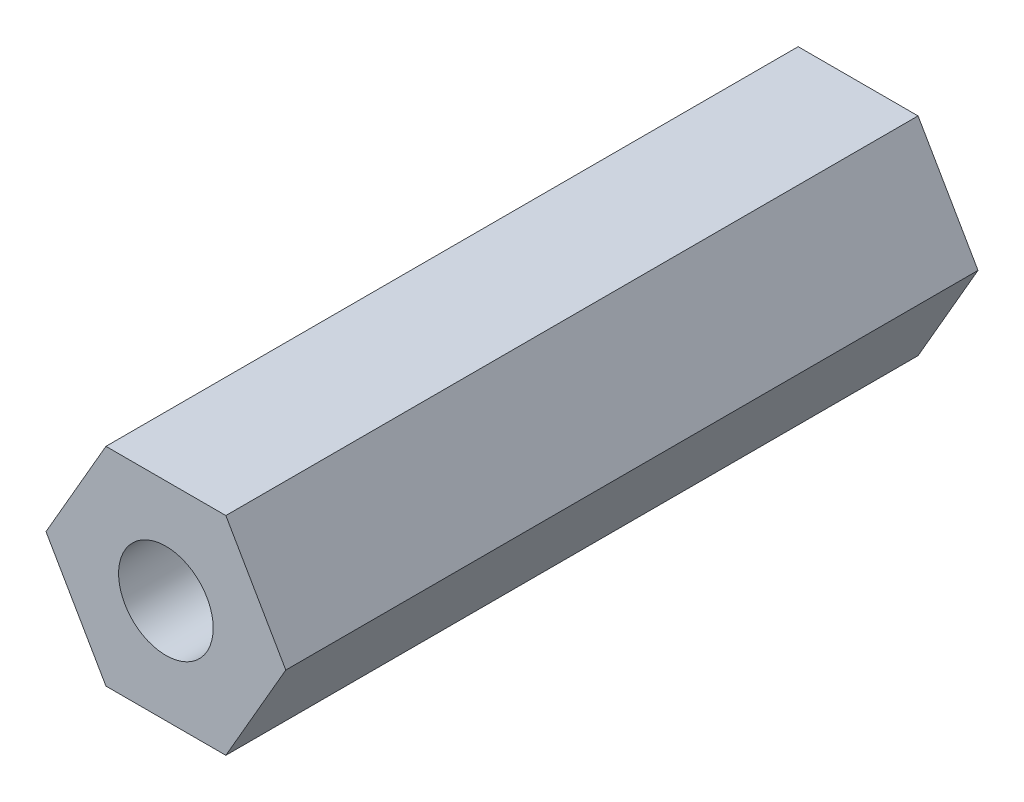
ISO-10303-21;
HEADER;
FILE_DESCRIPTION(('STEP AP214'),'2;1');
FILE_NAME('part.step','',(''),(''),'','','');
FILE_SCHEMA(('AUTOMOTIVE_DESIGN { 1 0 10303 214 1 1 1 1 }'));
ENDSEC;
DATA;
#1=APPLICATION_CONTEXT('core data for automotive mechanical design processes');
#2=APPLICATION_PROTOCOL_DEFINITION('international standard','automotive_design',2000,#1);
#3=PRODUCT_CONTEXT('',#1,'mechanical');
#4=PRODUCT('Part','Part','',(#3));
#5=PRODUCT_RELATED_PRODUCT_CATEGORY('part','',(#4));
#6=PRODUCT_DEFINITION_FORMATION('','',#4);
#7=PRODUCT_DEFINITION_CONTEXT('part definition',#1,'design');
#8=PRODUCT_DEFINITION('design','',#6,#7);
#9=PRODUCT_DEFINITION_SHAPE('','',#8);
#10=(LENGTH_UNIT() NAMED_UNIT(*) SI_UNIT(.MILLI.,.METRE.));
#11=(NAMED_UNIT(*) PLANE_ANGLE_UNIT() SI_UNIT($,.RADIAN.));
#12=(NAMED_UNIT(*) SI_UNIT($,.STERADIAN.) SOLID_ANGLE_UNIT());
#13=UNCERTAINTY_MEASURE_WITH_UNIT(LENGTH_MEASURE(1.E-05),#10,'distance_accuracy_value','');
#14=(GEOMETRIC_REPRESENTATION_CONTEXT(3) GLOBAL_UNCERTAINTY_ASSIGNED_CONTEXT((#13)) GLOBAL_UNIT_ASSIGNED_CONTEXT((#10,
#11,#12)) REPRESENTATION_CONTEXT('',''));
#15=CARTESIAN_POINT('',(0.,0.,0.));
#16=DIRECTION('',(0.,0.,1.));
#17=DIRECTION('',(1.,0.,0.));
#18=AXIS2_PLACEMENT_3D('',#15,#16,#17);
#19=CARTESIAN_POINT('',(1.29903810567666,2.25,15.));
#20=DIRECTION('',(0.,-1.,0.));
#21=DIRECTION('',(0.,0.,-1.));
#22=AXIS2_PLACEMENT_3D('',#19,#20,#21);
#23=PLANE('',#22);
#24=DIRECTION('',(-1.,0.,0.));
#25=VECTOR('',#24,1.);
#26=CARTESIAN_POINT('',(1.29903810567666,2.25,0.));
#27=LINE('',#26,#25);
#28=CARTESIAN_POINT('',(1.29903810567666,2.25,0.));
#29=VERTEX_POINT('',#28);
#30=CARTESIAN_POINT('',(-1.29903810567666,2.25,0.));
#31=VERTEX_POINT('',#30);
#32=EDGE_CURVE('E116',#29,#31,#27,.T.);
#33=ORIENTED_EDGE('',*,*,#32,.T.);
#34=DIRECTION('',(0.,0.,-1.));
#35=VECTOR('',#34,1.);
#36=CARTESIAN_POINT('',(-1.29903810567666,2.25,15.));
#37=LINE('',#36,#35);
#38=CARTESIAN_POINT('',(-1.29903810567666,2.25,15.));
#39=VERTEX_POINT('',#38);
#40=EDGE_CURVE('E11',#39,#31,#37,.T.);
#41=ORIENTED_EDGE('',*,*,#40,.F.);
#42=DIRECTION('',(-1.,0.,0.));
#43=VECTOR('',#42,1.);
#44=CARTESIAN_POINT('',(1.29903810567666,2.25,15.));
#45=LINE('',#44,#43);
#46=CARTESIAN_POINT('',(1.29903810567666,2.25,15.));
#47=VERTEX_POINT('',#46);
#48=EDGE_CURVE('E127',#47,#39,#45,.T.);
#49=ORIENTED_EDGE('',*,*,#48,.F.);
#50=DIRECTION('',(0.,0.,-1.));
#51=VECTOR('',#50,1.);
#52=CARTESIAN_POINT('',(1.29903810567666,2.25,15.));
#53=LINE('',#52,#51);
#54=EDGE_CURVE('E112',#47,#29,#53,.T.);
#55=ORIENTED_EDGE('',*,*,#54,.T.);
#56=EDGE_LOOP('',(#33,#41,#49,#55));
#57=FACE_BOUND('',#56,.T.);
#58=ADVANCED_FACE('F32',(#57),#23,.F.);
#59=CARTESIAN_POINT('',(-1.29903810567666,2.25,15.));
#60=DIRECTION('',(0.866025403784439,-0.5,0.));
#61=DIRECTION('',(0.5,0.866025403784439,0.));
#62=AXIS2_PLACEMENT_3D('',#59,#60,#61);
#63=PLANE('',#62);
#64=DIRECTION('',(-0.5,-0.866025403784439,0.));
#65=VECTOR('',#64,1.);
#66=CARTESIAN_POINT('',(-1.29903810567666,2.25,0.));
#67=LINE('',#66,#65);
#68=CARTESIAN_POINT('',(-2.59807621135332,0.,0.));
#69=VERTEX_POINT('',#68);
#70=EDGE_CURVE('E119',#31,#69,#67,.T.);
#71=ORIENTED_EDGE('',*,*,#70,.T.);
#72=DIRECTION('',(0.,0.,-1.));
#73=VECTOR('',#72,1.);
#74=CARTESIAN_POINT('',(-2.59807621135332,0.,15.));
#75=LINE('',#74,#73);
#76=CARTESIAN_POINT('',(-2.59807621135332,0.,15.));
#77=VERTEX_POINT('',#76);
#78=EDGE_CURVE('E40',#77,#69,#75,.T.);
#79=ORIENTED_EDGE('',*,*,#78,.F.);
#80=DIRECTION('',(-0.5,-0.866025403784439,0.));
#81=VECTOR('',#80,1.);
#82=CARTESIAN_POINT('',(-1.29903810567666,2.25,15.));
#83=LINE('',#82,#81);
#84=EDGE_CURVE('E85',#39,#77,#83,.T.);
#85=ORIENTED_EDGE('',*,*,#84,.F.);
#86=ORIENTED_EDGE('',*,*,#40,.T.);
#87=EDGE_LOOP('',(#71,#79,#85,#86));
#88=FACE_BOUND('',#87,.T.);
#89=ADVANCED_FACE('F152',(#88),#63,.F.);
#90=CARTESIAN_POINT('',(-2.59807621135332,0.,15.));
#91=DIRECTION('',(0.866025403784438,0.5,0.));
#92=DIRECTION('',(-0.5,0.866025403784439,0.));
#93=AXIS2_PLACEMENT_3D('',#90,#91,#92);
#94=PLANE('',#93);
#95=DIRECTION('',(0.5,-0.866025403784438,0.));
#96=VECTOR('',#95,1.);
#97=CARTESIAN_POINT('',(-2.59807621135332,0.,0.));
#98=LINE('',#97,#96);
#99=CARTESIAN_POINT('',(-1.29903810567666,-2.25,0.));
#100=VERTEX_POINT('',#99);
#101=EDGE_CURVE('E122',#69,#100,#98,.T.);
#102=ORIENTED_EDGE('',*,*,#101,.T.);
#103=DIRECTION('',(0.,0.,-1.));
#104=VECTOR('',#103,1.);
#105=CARTESIAN_POINT('',(-1.29903810567666,-2.25,15.));
#106=LINE('',#105,#104);
#107=CARTESIAN_POINT('',(-1.29903810567666,-2.25,15.));
#108=VERTEX_POINT('',#107);
#109=EDGE_CURVE('E107',#108,#100,#106,.T.);
#110=ORIENTED_EDGE('',*,*,#109,.F.);
#111=DIRECTION('',(0.5,-0.866025403784438,0.));
#112=VECTOR('',#111,1.);
#113=CARTESIAN_POINT('',(-2.59807621135332,0.,15.));
#114=LINE('',#113,#112);
#115=EDGE_CURVE('E98',#77,#108,#114,.T.);
#116=ORIENTED_EDGE('',*,*,#115,.F.);
#117=ORIENTED_EDGE('',*,*,#78,.T.);
#118=EDGE_LOOP('',(#102,#110,#116,#117));
#119=FACE_BOUND('',#118,.T.);
#120=ADVANCED_FACE('F133',(#119),#94,.F.);
#121=CARTESIAN_POINT('',(-1.29903810567666,-2.25,15.));
#122=DIRECTION('',(0.,1.,0.));
#123=DIRECTION('',(-1.,0.,0.));
#124=AXIS2_PLACEMENT_3D('',#121,#122,#123);
#125=PLANE('',#124);
#126=DIRECTION('',(1.,0.,0.));
#127=VECTOR('',#126,1.);
#128=CARTESIAN_POINT('',(-1.29903810567666,-2.25,0.));
#129=LINE('',#128,#127);
#130=CARTESIAN_POINT('',(1.29903810567666,-2.25,0.));
#131=VERTEX_POINT('',#130);
#132=EDGE_CURVE('E106',#100,#131,#129,.T.);
#133=ORIENTED_EDGE('',*,*,#132,.T.);
#134=DIRECTION('',(0.,0.,-1.));
#135=VECTOR('',#134,1.);
#136=CARTESIAN_POINT('',(1.29903810567666,-2.25,15.));
#137=LINE('',#136,#135);
#138=CARTESIAN_POINT('',(1.29903810567666,-2.25,15.));
#139=VERTEX_POINT('',#138);
#140=EDGE_CURVE('E103',#139,#131,#137,.T.);
#141=ORIENTED_EDGE('',*,*,#140,.F.);
#142=DIRECTION('',(1.,0.,0.));
#143=VECTOR('',#142,1.);
#144=CARTESIAN_POINT('',(-1.29903810567666,-2.25,15.));
#145=LINE('',#144,#143);
#146=EDGE_CURVE('E92',#108,#139,#145,.T.);
#147=ORIENTED_EDGE('',*,*,#146,.F.);
#148=ORIENTED_EDGE('',*,*,#109,.T.);
#149=EDGE_LOOP('',(#133,#141,#147,#148));
#150=FACE_BOUND('',#149,.T.);
#151=ADVANCED_FACE('F104',(#150),#125,.F.);
#152=CARTESIAN_POINT('',(1.29903810567666,-2.25,15.));
#153=DIRECTION('',(-0.866025403784439,0.5,0.));
#154=DIRECTION('',(-0.5,-0.866025403784439,0.));
#155=AXIS2_PLACEMENT_3D('',#152,#153,#154);
#156=PLANE('',#155);
#157=DIRECTION('',(0.5,0.866025403784439,0.));
#158=VECTOR('',#157,1.);
#159=CARTESIAN_POINT('',(1.29903810567666,-2.25,0.));
#160=LINE('',#159,#158);
#161=CARTESIAN_POINT('',(2.59807621135332,0.,0.));
#162=VERTEX_POINT('',#161);
#163=EDGE_CURVE('E71',#131,#162,#160,.T.);
#164=ORIENTED_EDGE('',*,*,#163,.T.);
#165=DIRECTION('',(0.,0.,-1.));
#166=VECTOR('',#165,1.);
#167=CARTESIAN_POINT('',(2.59807621135332,0.,15.));
#168=LINE('',#167,#166);
#169=CARTESIAN_POINT('',(2.59807621135332,0.,15.));
#170=VERTEX_POINT('',#169);
#171=EDGE_CURVE('E108',#170,#162,#168,.T.);
#172=ORIENTED_EDGE('',*,*,#171,.F.);
#173=DIRECTION('',(0.5,0.866025403784439,0.));
#174=VECTOR('',#173,1.);
#175=CARTESIAN_POINT('',(1.29903810567666,-2.25,15.));
#176=LINE('',#175,#174);
#177=EDGE_CURVE('E96',#139,#170,#176,.T.);
#178=ORIENTED_EDGE('',*,*,#177,.F.);
#179=ORIENTED_EDGE('',*,*,#140,.T.);
#180=EDGE_LOOP('',(#164,#172,#178,#179));
#181=FACE_BOUND('',#180,.T.);
#182=ADVANCED_FACE('F110',(#181),#156,.F.);
#183=CARTESIAN_POINT('',(2.59807621135332,0.,15.));
#184=DIRECTION('',(-0.866025403784438,-0.5,0.));
#185=DIRECTION('',(0.5,-0.866025403784439,0.));
#186=AXIS2_PLACEMENT_3D('',#183,#184,#185);
#187=PLANE('',#186);
#188=DIRECTION('',(-0.5,0.866025403784438,0.));
#189=VECTOR('',#188,1.);
#190=CARTESIAN_POINT('',(2.59807621135332,0.,0.));
#191=LINE('',#190,#189);
#192=EDGE_CURVE('E77',#162,#29,#191,.T.);
#193=ORIENTED_EDGE('',*,*,#192,.T.);
#194=ORIENTED_EDGE('',*,*,#54,.F.);
#195=DIRECTION('',(-0.5,0.866025403784438,0.));
#196=VECTOR('',#195,1.);
#197=CARTESIAN_POINT('',(2.59807621135332,0.,15.));
#198=LINE('',#197,#196);
#199=EDGE_CURVE('E48',#170,#47,#198,.T.);
#200=ORIENTED_EDGE('',*,*,#199,.F.);
#201=ORIENTED_EDGE('',*,*,#171,.T.);
#202=EDGE_LOOP('',(#193,#194,#200,#201));
#203=FACE_BOUND('',#202,.T.);
#204=ADVANCED_FACE('F140',(#203),#187,.F.);
#205=CARTESIAN_POINT('',(-1.29903810567666,2.25,15.));
#206=DIRECTION('',(0.,0.,1.));
#207=DIRECTION('',(1.,0.,0.));
#208=AXIS2_PLACEMENT_3D('',#205,#206,#207);
#209=PLANE('',#208);
#210=CARTESIAN_POINT('',(0.,0.,15.));
#211=DIRECTION('',(0.,0.,1.));
#212=DIRECTION('',(1.,0.,0.));
#213=AXIS2_PLACEMENT_3D('',#210,#211,#212);
#214=CIRCLE('',#213,1.025);
#215=CARTESIAN_POINT('',(1.025,0.,15.));
#216=VERTEX_POINT('',#215);
#217=EDGE_CURVE('E216',#216,#216,#214,.T.);
#218=ORIENTED_EDGE('',*,*,#217,.F.);
#219=EDGE_LOOP('',(#218));
#220=FACE_BOUND('',#219,.T.);
#221=ORIENTED_EDGE('',*,*,#48,.T.);
#222=ORIENTED_EDGE('',*,*,#84,.T.);
#223=ORIENTED_EDGE('',*,*,#115,.T.);
#224=ORIENTED_EDGE('',*,*,#146,.T.);
#225=ORIENTED_EDGE('',*,*,#177,.T.);
#226=ORIENTED_EDGE('',*,*,#199,.T.);
#227=EDGE_LOOP('',(#221,#222,#223,#224,#225,#226));
#228=FACE_BOUND('',#227,.T.);
#229=ADVANCED_FACE('F94',(#220,#228),#209,.T.);
#230=CARTESIAN_POINT('',(-1.29903810567666,2.25,0.));
#231=DIRECTION('',(0.,0.,1.));
#232=DIRECTION('',(1.,0.,0.));
#233=AXIS2_PLACEMENT_3D('',#230,#231,#232);
#234=PLANE('',#233);
#235=ORIENTED_EDGE('',*,*,#32,.F.);
#236=ORIENTED_EDGE('',*,*,#192,.F.);
#237=ORIENTED_EDGE('',*,*,#163,.F.);
#238=ORIENTED_EDGE('',*,*,#132,.F.);
#239=ORIENTED_EDGE('',*,*,#101,.F.);
#240=ORIENTED_EDGE('',*,*,#70,.F.);
#241=EDGE_LOOP('',(#235,#236,#237,#238,#239,#240));
#242=FACE_BOUND('',#241,.T.);
#243=ADVANCED_FACE('F136',(#242),#234,.F.);
#244=CARTESIAN_POINT('',(0.,0.,3.5));
#245=DIRECTION('',(0.,0.,-1.));
#246=DIRECTION('',(-1.,0.,0.));
#247=AXIS2_PLACEMENT_3D('',#244,#245,#246);
#248=PLANE('',#247);
#249=CARTESIAN_POINT('',(0.,0.,3.5));
#250=DIRECTION('',(0.,0.,1.));
#251=DIRECTION('',(1.,0.,0.));
#252=AXIS2_PLACEMENT_3D('',#249,#250,#251);
#253=CIRCLE('',#252,1.025);
#254=CARTESIAN_POINT('',(1.025,0.,3.5));
#255=VERTEX_POINT('',#254);
#256=EDGE_CURVE('E120',#255,#255,#253,.T.);
#257=ORIENTED_EDGE('',*,*,#256,.T.);
#258=EDGE_LOOP('',(#257));
#259=FACE_BOUND('',#258,.T.);
#260=ADVANCED_FACE('F184',(#259),#248,.F.);
#261=CARTESIAN_POINT('',(0.,0.,15.));
#262=DIRECTION('',(0.,0.,1.));
#263=DIRECTION('',(1.,0.,0.));
#264=AXIS2_PLACEMENT_3D('',#261,#262,#263);
#265=CYLINDRICAL_SURFACE('',#264,1.025);
#266=ORIENTED_EDGE('',*,*,#256,.F.);
#267=EDGE_LOOP('',(#266));
#268=FACE_BOUND('',#267,.T.);
#269=ORIENTED_EDGE('',*,*,#217,.T.);
#270=EDGE_LOOP('',(#269));
#271=FACE_BOUND('',#270,.T.);
#272=ADVANCED_FACE('F197',(#268,#271),#265,.F.);
#273=CLOSED_SHELL('',(#58,#89,#120,#151,#182,#204,#229,#243,#260,#272));
#274=MANIFOLD_SOLID_BREP('B2',#273);
#275=ADVANCED_BREP_SHAPE_REPRESENTATION('',(#18,#274),#14);
#276=SHAPE_DEFINITION_REPRESENTATION(#9,#275);
ENDSEC;
END-ISO-10303-21;
